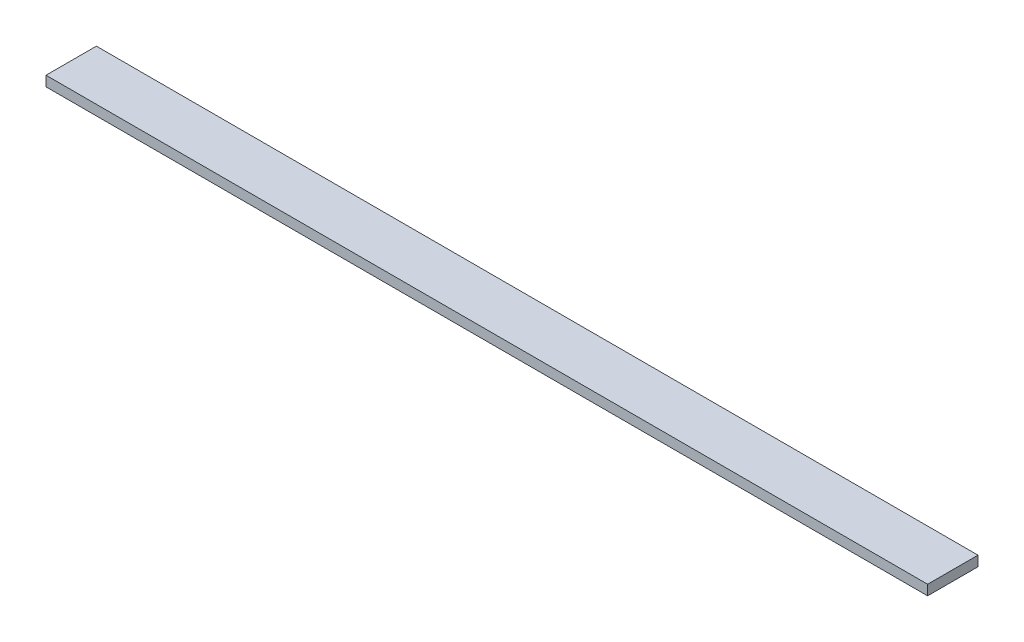
ISO-10303-21;
HEADER;
FILE_DESCRIPTION(('STEP AP214'),'2;1');
FILE_NAME('part.step','',(''),(''),'','','');
FILE_SCHEMA(('AUTOMOTIVE_DESIGN { 1 0 10303 214 1 1 1 1 }'));
ENDSEC;
DATA;
#1=APPLICATION_CONTEXT('core data for automotive mechanical design processes');
#2=APPLICATION_PROTOCOL_DEFINITION('international standard','automotive_design',2000,#1);
#3=PRODUCT_CONTEXT('',#1,'mechanical');
#4=PRODUCT('Part','Part','',(#3));
#5=PRODUCT_RELATED_PRODUCT_CATEGORY('part','',(#4));
#6=PRODUCT_DEFINITION_FORMATION('','',#4);
#7=PRODUCT_DEFINITION_CONTEXT('part definition',#1,'design');
#8=PRODUCT_DEFINITION('design','',#6,#7);
#9=PRODUCT_DEFINITION_SHAPE('','',#8);
#10=(LENGTH_UNIT() NAMED_UNIT(*) SI_UNIT(.MILLI.,.METRE.));
#11=(NAMED_UNIT(*) PLANE_ANGLE_UNIT() SI_UNIT($,.RADIAN.));
#12=(NAMED_UNIT(*) SI_UNIT($,.STERADIAN.) SOLID_ANGLE_UNIT());
#13=UNCERTAINTY_MEASURE_WITH_UNIT(LENGTH_MEASURE(1.E-05),#10,'distance_accuracy_value','');
#14=(GEOMETRIC_REPRESENTATION_CONTEXT(3) GLOBAL_UNCERTAINTY_ASSIGNED_CONTEXT((#13)) GLOBAL_UNIT_ASSIGNED_CONTEXT((#10,
#11,#12)) REPRESENTATION_CONTEXT('',''));
#15=CARTESIAN_POINT('',(0.,0.,0.));
#16=DIRECTION('',(0.,0.,1.));
#17=DIRECTION('',(1.,0.,0.));
#18=AXIS2_PLACEMENT_3D('',#15,#16,#17);
#19=CARTESIAN_POINT('',(350.,0.,0.));
#20=DIRECTION('',(0.,0.,-1.));
#21=DIRECTION('',(-1.,0.,0.));
#22=AXIS2_PLACEMENT_3D('',#19,#20,#21);
#23=PLANE('',#22);
#24=DIRECTION('',(0.,-1.,0.));
#25=VECTOR('',#24,1.);
#26=CARTESIAN_POINT('',(0.,0.,0.));
#27=LINE('',#26,#25);
#28=CARTESIAN_POINT('',(0.,4.,0.));
#29=VERTEX_POINT('',#28);
#30=CARTESIAN_POINT('',(0.,0.,0.));
#31=VERTEX_POINT('',#30);
#32=EDGE_CURVE('E97',#29,#31,#27,.T.);
#33=ORIENTED_EDGE('',*,*,#32,.T.);
#34=DIRECTION('',(-1.,0.,0.));
#35=VECTOR('',#34,1.);
#36=CARTESIAN_POINT('',(350.,0.,0.));
#37=LINE('',#36,#35);
#38=CARTESIAN_POINT('',(350.,0.,0.));
#39=VERTEX_POINT('',#38);
#40=EDGE_CURVE('E11',#39,#31,#37,.T.);
#41=ORIENTED_EDGE('',*,*,#40,.F.);
#42=DIRECTION('',(0.,-1.,0.));
#43=VECTOR('',#42,1.);
#44=CARTESIAN_POINT('',(350.,0.,0.));
#45=LINE('',#44,#43);
#46=CARTESIAN_POINT('',(350.,4.,0.));
#47=VERTEX_POINT('',#46);
#48=EDGE_CURVE('E85',#47,#39,#45,.T.);
#49=ORIENTED_EDGE('',*,*,#48,.F.);
#50=DIRECTION('',(-1.,0.,0.));
#51=VECTOR('',#50,1.);
#52=CARTESIAN_POINT('',(350.,4.,0.));
#53=LINE('',#52,#51);
#54=EDGE_CURVE('E93',#47,#29,#53,.T.);
#55=ORIENTED_EDGE('',*,*,#54,.T.);
#56=EDGE_LOOP('',(#33,#41,#49,#55));
#57=FACE_BOUND('',#56,.T.);
#58=ADVANCED_FACE('F34',(#57),#23,.F.);
#59=CARTESIAN_POINT('',(350.,0.,0.));
#60=DIRECTION('',(0.,1.,0.));
#61=DIRECTION('',(0.,0.,1.));
#62=AXIS2_PLACEMENT_3D('',#59,#60,#61);
#63=PLANE('',#62);
#64=DIRECTION('',(0.,0.,-1.));
#65=VECTOR('',#64,1.);
#66=CARTESIAN_POINT('',(0.,0.,0.));
#67=LINE('',#66,#65);
#68=CARTESIAN_POINT('',(0.,0.,-20.));
#69=VERTEX_POINT('',#68);
#70=EDGE_CURVE('E89',#31,#69,#67,.T.);
#71=ORIENTED_EDGE('',*,*,#70,.T.);
#72=DIRECTION('',(-1.,0.,0.));
#73=VECTOR('',#72,1.);
#74=CARTESIAN_POINT('',(350.,0.,-20.));
#75=LINE('',#74,#73);
#76=CARTESIAN_POINT('',(350.,0.,-20.));
#77=VERTEX_POINT('',#76);
#78=EDGE_CURVE('E42',#77,#69,#75,.T.);
#79=ORIENTED_EDGE('',*,*,#78,.F.);
#80=DIRECTION('',(0.,0.,-1.));
#81=VECTOR('',#80,1.);
#82=CARTESIAN_POINT('',(350.,0.,0.));
#83=LINE('',#82,#81);
#84=EDGE_CURVE('E80',#39,#77,#83,.T.);
#85=ORIENTED_EDGE('',*,*,#84,.F.);
#86=ORIENTED_EDGE('',*,*,#40,.T.);
#87=EDGE_LOOP('',(#71,#79,#85,#86));
#88=FACE_BOUND('',#87,.T.);
#89=ADVANCED_FACE('F88',(#88),#63,.F.);
#90=CARTESIAN_POINT('',(350.,0.,-20.));
#91=DIRECTION('',(0.,0.,1.));
#92=DIRECTION('',(1.,0.,0.));
#93=AXIS2_PLACEMENT_3D('',#90,#91,#92);
#94=PLANE('',#93);
#95=DIRECTION('',(0.,1.,0.));
#96=VECTOR('',#95,1.);
#97=CARTESIAN_POINT('',(0.,0.,-20.));
#98=LINE('',#97,#96);
#99=CARTESIAN_POINT('',(0.,4.,-20.));
#100=VERTEX_POINT('',#99);
#101=EDGE_CURVE('E67',#69,#100,#98,.T.);
#102=ORIENTED_EDGE('',*,*,#101,.T.);
#103=DIRECTION('',(-1.,0.,0.));
#104=VECTOR('',#103,1.);
#105=CARTESIAN_POINT('',(350.,4.,-20.));
#106=LINE('',#105,#104);
#107=CARTESIAN_POINT('',(350.,4.,-20.));
#108=VERTEX_POINT('',#107);
#109=EDGE_CURVE('E90',#108,#100,#106,.T.);
#110=ORIENTED_EDGE('',*,*,#109,.F.);
#111=DIRECTION('',(0.,1.,0.));
#112=VECTOR('',#111,1.);
#113=CARTESIAN_POINT('',(350.,0.,-20.));
#114=LINE('',#113,#112);
#115=EDGE_CURVE('E83',#77,#108,#114,.T.);
#116=ORIENTED_EDGE('',*,*,#115,.F.);
#117=ORIENTED_EDGE('',*,*,#78,.T.);
#118=EDGE_LOOP('',(#102,#110,#116,#117));
#119=FACE_BOUND('',#118,.T.);
#120=ADVANCED_FACE('F91',(#119),#94,.F.);
#121=CARTESIAN_POINT('',(350.,4.,0.));
#122=DIRECTION('',(0.,-1.,0.));
#123=DIRECTION('',(0.,0.,-1.));
#124=AXIS2_PLACEMENT_3D('',#121,#122,#123);
#125=PLANE('',#124);
#126=DIRECTION('',(0.,0.,1.));
#127=VECTOR('',#126,1.);
#128=CARTESIAN_POINT('',(0.,4.,0.));
#129=LINE('',#128,#127);
#130=EDGE_CURVE('E73',#100,#29,#129,.T.);
#131=ORIENTED_EDGE('',*,*,#130,.T.);
#132=ORIENTED_EDGE('',*,*,#54,.F.);
#133=DIRECTION('',(0.,0.,1.));
#134=VECTOR('',#133,1.);
#135=CARTESIAN_POINT('',(350.,4.,0.));
#136=LINE('',#135,#134);
#137=EDGE_CURVE('E50',#108,#47,#136,.T.);
#138=ORIENTED_EDGE('',*,*,#137,.F.);
#139=ORIENTED_EDGE('',*,*,#109,.T.);
#140=EDGE_LOOP('',(#131,#132,#138,#139));
#141=FACE_BOUND('',#140,.T.);
#142=ADVANCED_FACE('F104',(#141),#125,.F.);
#143=CARTESIAN_POINT('',(350.,0.,0.));
#144=DIRECTION('',(-1.,0.,0.));
#145=DIRECTION('',(0.,0.,1.));
#146=AXIS2_PLACEMENT_3D('',#143,#144,#145);
#147=PLANE('',#146);
#148=ORIENTED_EDGE('',*,*,#48,.T.);
#149=ORIENTED_EDGE('',*,*,#84,.T.);
#150=ORIENTED_EDGE('',*,*,#115,.T.);
#151=ORIENTED_EDGE('',*,*,#137,.T.);
#152=EDGE_LOOP('',(#148,#149,#150,#151));
#153=FACE_BOUND('',#152,.T.);
#154=ADVANCED_FACE('F81',(#153),#147,.F.);
#155=CARTESIAN_POINT('',(0.,0.,0.));
#156=DIRECTION('',(-1.,0.,0.));
#157=DIRECTION('',(0.,0.,1.));
#158=AXIS2_PLACEMENT_3D('',#155,#156,#157);
#159=PLANE('',#158);
#160=ORIENTED_EDGE('',*,*,#32,.F.);
#161=ORIENTED_EDGE('',*,*,#130,.F.);
#162=ORIENTED_EDGE('',*,*,#101,.F.);
#163=ORIENTED_EDGE('',*,*,#70,.F.);
#164=EDGE_LOOP('',(#160,#161,#162,#163));
#165=FACE_BOUND('',#164,.T.);
#166=ADVANCED_FACE('F107',(#165),#159,.T.);
#167=CLOSED_SHELL('',(#58,#89,#120,#142,#154,#166));
#168=MANIFOLD_SOLID_BREP('B2',#167);
#169=ADVANCED_BREP_SHAPE_REPRESENTATION('',(#18,#168),#14);
#170=SHAPE_DEFINITION_REPRESENTATION(#9,#169);
ENDSEC;
END-ISO-10303-21;
